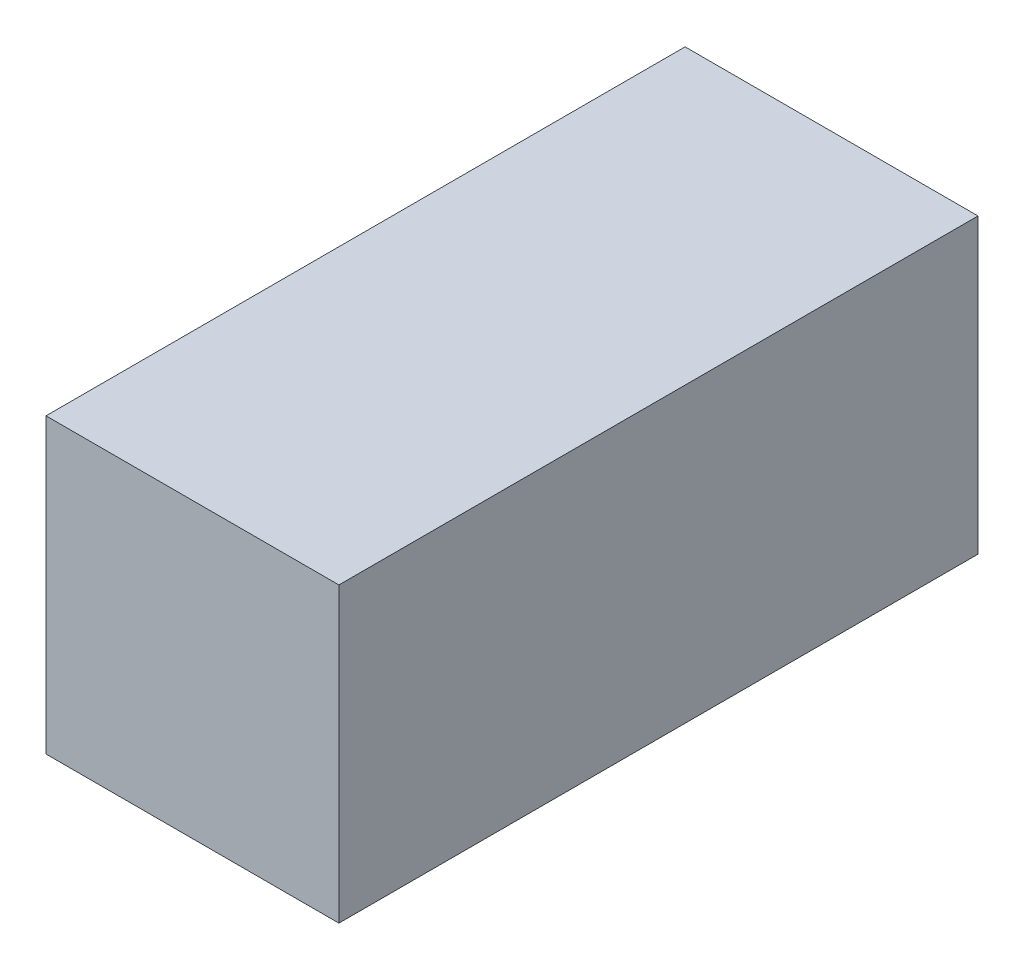
ISO-10303-21;
HEADER;
FILE_DESCRIPTION(('STEP AP214'),'2;1');
FILE_NAME('part.step','',(''),(''),'','','');
FILE_SCHEMA(('AUTOMOTIVE_DESIGN { 1 0 10303 214 1 1 1 1 }'));
ENDSEC;
DATA;
#1=APPLICATION_CONTEXT('core data for automotive mechanical design processes');
#2=APPLICATION_PROTOCOL_DEFINITION('international standard','automotive_design',2000,#1);
#3=PRODUCT_CONTEXT('',#1,'mechanical');
#4=PRODUCT('Part','Part','',(#3));
#5=PRODUCT_RELATED_PRODUCT_CATEGORY('part','',(#4));
#6=PRODUCT_DEFINITION_FORMATION('','',#4);
#7=PRODUCT_DEFINITION_CONTEXT('part definition',#1,'design');
#8=PRODUCT_DEFINITION('design','',#6,#7);
#9=PRODUCT_DEFINITION_SHAPE('','',#8);
#10=(LENGTH_UNIT() NAMED_UNIT(*) SI_UNIT(.MILLI.,.METRE.));
#11=(NAMED_UNIT(*) PLANE_ANGLE_UNIT() SI_UNIT($,.RADIAN.));
#12=(NAMED_UNIT(*) SI_UNIT($,.STERADIAN.) SOLID_ANGLE_UNIT());
#13=UNCERTAINTY_MEASURE_WITH_UNIT(LENGTH_MEASURE(1.E-05),#10,'distance_accuracy_value','');
#14=(GEOMETRIC_REPRESENTATION_CONTEXT(3) GLOBAL_UNCERTAINTY_ASSIGNED_CONTEXT((#13)) GLOBAL_UNIT_ASSIGNED_CONTEXT((#10,
#11,#12)) REPRESENTATION_CONTEXT('',''));
#15=CARTESIAN_POINT('',(0.,0.,0.));
#16=DIRECTION('',(0.,0.,1.));
#17=DIRECTION('',(1.,0.,0.));
#18=AXIS2_PLACEMENT_3D('',#15,#16,#17);
#19=CARTESIAN_POINT('',(139.7,279.4,-304.8));
#20=DIRECTION('',(-1.,0.,0.));
#21=DIRECTION('',(0.,0.,1.));
#22=AXIS2_PLACEMENT_3D('',#19,#20,#21);
#23=PLANE('',#22);
#24=DIRECTION('',(0.,0.,-1.));
#25=VECTOR('',#24,1.);
#26=CARTESIAN_POINT('',(139.7,0.,-304.8));
#27=LINE('',#26,#25);
#28=CARTESIAN_POINT('',(139.7,0.,304.8));
#29=VERTEX_POINT('',#28);
#30=CARTESIAN_POINT('',(139.7,0.,-304.8));
#31=VERTEX_POINT('',#30);
#32=EDGE_CURVE('E132',#29,#31,#27,.T.);
#33=ORIENTED_EDGE('',*,*,#32,.T.);
#34=DIRECTION('',(0.,-1.,0.));
#35=VECTOR('',#34,1.);
#36=CARTESIAN_POINT('',(139.7,279.4,-304.8));
#37=LINE('',#36,#35);
#38=CARTESIAN_POINT('',(139.7,279.4,-304.8));
#39=VERTEX_POINT('',#38);
#40=EDGE_CURVE('E11',#39,#31,#37,.T.);
#41=ORIENTED_EDGE('',*,*,#40,.F.);
#42=DIRECTION('',(0.,0.,-1.));
#43=VECTOR('',#42,1.);
#44=CARTESIAN_POINT('',(139.7,279.4,-304.8));
#45=LINE('',#44,#43);
#46=CARTESIAN_POINT('',(139.7,279.4,304.8));
#47=VERTEX_POINT('',#46);
#48=EDGE_CURVE('E142',#47,#39,#45,.T.);
#49=ORIENTED_EDGE('',*,*,#48,.F.);
#50=DIRECTION('',(0.,-1.,0.));
#51=VECTOR('',#50,1.);
#52=CARTESIAN_POINT('',(139.7,279.4,304.8));
#53=LINE('',#52,#51);
#54=EDGE_CURVE('E147',#47,#29,#53,.T.);
#55=ORIENTED_EDGE('',*,*,#54,.T.);
#56=EDGE_LOOP('',(#33,#41,#49,#55));
#57=FACE_BOUND('',#56,.T.);
#58=ADVANCED_FACE('F34',(#57),#23,.F.);
#59=CARTESIAN_POINT('',(-139.7,279.4,-304.8));
#60=DIRECTION('',(0.,0.,1.));
#61=DIRECTION('',(1.,0.,0.));
#62=AXIS2_PLACEMENT_3D('',#59,#60,#61);
#63=PLANE('',#62);
#64=DIRECTION('',(-1.,0.,0.));
#65=VECTOR('',#64,1.);
#66=CARTESIAN_POINT('',(-139.7,0.,-304.8));
#67=LINE('',#66,#65);
#68=CARTESIAN_POINT('',(-139.7,0.,-304.8));
#69=VERTEX_POINT('',#68);
#70=EDGE_CURVE('E136',#31,#69,#67,.T.);
#71=ORIENTED_EDGE('',*,*,#70,.T.);
#72=DIRECTION('',(0.,-1.,0.));
#73=VECTOR('',#72,1.);
#74=CARTESIAN_POINT('',(-139.7,279.4,-304.8));
#75=LINE('',#74,#73);
#76=CARTESIAN_POINT('',(-139.7,279.4,-304.8));
#77=VERTEX_POINT('',#76);
#78=EDGE_CURVE('E42',#77,#69,#75,.T.);
#79=ORIENTED_EDGE('',*,*,#78,.F.);
#80=DIRECTION('',(-1.,0.,0.));
#81=VECTOR('',#80,1.);
#82=CARTESIAN_POINT('',(-139.7,279.4,-304.8));
#83=LINE('',#82,#81);
#84=EDGE_CURVE('E81',#39,#77,#83,.T.);
#85=ORIENTED_EDGE('',*,*,#84,.F.);
#86=ORIENTED_EDGE('',*,*,#40,.T.);
#87=EDGE_LOOP('',(#71,#79,#85,#86));
#88=FACE_BOUND('',#87,.T.);
#89=ADVANCED_FACE('F171',(#88),#63,.F.);
#90=CARTESIAN_POINT('',(-139.7,279.4,-304.8));
#91=DIRECTION('',(1.,0.,0.));
#92=DIRECTION('',(0.,0.,-1.));
#93=AXIS2_PLACEMENT_3D('',#90,#91,#92);
#94=PLANE('',#93);
#95=DIRECTION('',(0.,0.,1.));
#96=VECTOR('',#95,1.);
#97=CARTESIAN_POINT('',(-139.7,0.,-304.8));
#98=LINE('',#97,#96);
#99=CARTESIAN_POINT('',(-139.7,0.,304.8));
#100=VERTEX_POINT('',#99);
#101=EDGE_CURVE('E68',#69,#100,#98,.T.);
#102=ORIENTED_EDGE('',*,*,#101,.T.);
#103=DIRECTION('',(0.,-1.,0.));
#104=VECTOR('',#103,1.);
#105=CARTESIAN_POINT('',(-139.7,279.4,304.8));
#106=LINE('',#105,#104);
#107=CARTESIAN_POINT('',(-139.7,279.4,304.8));
#108=VERTEX_POINT('',#107);
#109=EDGE_CURVE('E153',#108,#100,#106,.T.);
#110=ORIENTED_EDGE('',*,*,#109,.F.);
#111=DIRECTION('',(0.,0.,1.));
#112=VECTOR('',#111,1.);
#113=CARTESIAN_POINT('',(-139.7,279.4,-304.8));
#114=LINE('',#113,#112);
#115=EDGE_CURVE('E145',#77,#108,#114,.T.);
#116=ORIENTED_EDGE('',*,*,#115,.F.);
#117=ORIENTED_EDGE('',*,*,#78,.T.);
#118=EDGE_LOOP('',(#102,#110,#116,#117));
#119=FACE_BOUND('',#118,.T.);
#120=ADVANCED_FACE('F155',(#119),#94,.F.);
#121=CARTESIAN_POINT('',(-139.7,279.4,304.8));
#122=DIRECTION('',(0.,0.,-1.));
#123=DIRECTION('',(-1.,0.,0.));
#124=AXIS2_PLACEMENT_3D('',#121,#122,#123);
#125=PLANE('',#124);
#126=DIRECTION('',(1.,0.,0.));
#127=VECTOR('',#126,1.);
#128=CARTESIAN_POINT('',(-139.7,0.,304.8));
#129=LINE('',#128,#127);
#130=EDGE_CURVE('E74',#100,#29,#129,.T.);
#131=ORIENTED_EDGE('',*,*,#130,.T.);
#132=ORIENTED_EDGE('',*,*,#54,.F.);
#133=DIRECTION('',(1.,0.,0.));
#134=VECTOR('',#133,1.);
#135=CARTESIAN_POINT('',(-139.7,279.4,304.8));
#136=LINE('',#135,#134);
#137=EDGE_CURVE('E50',#108,#47,#136,.T.);
#138=ORIENTED_EDGE('',*,*,#137,.F.);
#139=ORIENTED_EDGE('',*,*,#109,.T.);
#140=EDGE_LOOP('',(#131,#132,#138,#139));
#141=FACE_BOUND('',#140,.T.);
#142=ADVANCED_FACE('F162',(#141),#125,.F.);
#143=CARTESIAN_POINT('',(0.,279.4,0.));
#144=DIRECTION('',(0.,1.,0.));
#145=DIRECTION('',(0.,0.,1.));
#146=AXIS2_PLACEMENT_3D('',#143,#144,#145);
#147=PLANE('',#146);
#148=ORIENTED_EDGE('',*,*,#48,.T.);
#149=ORIENTED_EDGE('',*,*,#84,.T.);
#150=ORIENTED_EDGE('',*,*,#115,.T.);
#151=ORIENTED_EDGE('',*,*,#137,.T.);
#152=EDGE_LOOP('',(#148,#149,#150,#151));
#153=FACE_BOUND('',#152,.T.);
#154=ADVANCED_FACE('F164',(#153),#147,.T.);
#155=CARTESIAN_POINT('',(0.,0.,0.));
#156=DIRECTION('',(0.,1.,0.));
#157=DIRECTION('',(0.,0.,1.));
#158=AXIS2_PLACEMENT_3D('',#155,#156,#157);
#159=PLANE('',#158);
#160=ORIENTED_EDGE('',*,*,#32,.F.);
#161=ORIENTED_EDGE('',*,*,#130,.F.);
#162=ORIENTED_EDGE('',*,*,#101,.F.);
#163=ORIENTED_EDGE('',*,*,#70,.F.);
#164=EDGE_LOOP('',(#160,#161,#162,#163));
#165=FACE_BOUND('',#164,.T.);
#166=ADVANCED_FACE('F158',(#165),#159,.F.);
#167=CLOSED_SHELL('',(#58,#89,#120,#142,#154,#166));
#168=CARTESIAN_POINT('',(137.16,276.86,-304.8));
#169=DIRECTION('',(-1.,0.,0.));
#170=DIRECTION('',(0.,0.,1.));
#171=AXIS2_PLACEMENT_3D('',#168,#169,#170);
#172=PLANE('',#171);
#173=DIRECTION('',(0.,0.,-1.));
#174=VECTOR('',#173,1.);
#175=CARTESIAN_POINT('',(137.16,2.54,-304.8));
#176=LINE('',#175,#174);
#177=CARTESIAN_POINT('',(137.16,2.54,302.26));
#178=VERTEX_POINT('',#177);
#179=CARTESIAN_POINT('',(137.16,2.54,-302.26));
#180=VERTEX_POINT('',#179);
#181=EDGE_CURVE('E261',#178,#180,#176,.T.);
#182=ORIENTED_EDGE('',*,*,#181,.F.);
#183=DIRECTION('',(0.,-1.,0.));
#184=VECTOR('',#183,1.);
#185=CARTESIAN_POINT('',(137.16,276.86,302.26));
#186=LINE('',#185,#184);
#187=CARTESIAN_POINT('',(137.16,276.86,302.26));
#188=VERTEX_POINT('',#187);
#189=EDGE_CURVE('E127',#188,#178,#186,.T.);
#190=ORIENTED_EDGE('',*,*,#189,.F.);
#191=DIRECTION('',(0.,0.,-1.));
#192=VECTOR('',#191,1.);
#193=CARTESIAN_POINT('',(137.16,276.86,-304.8));
#194=LINE('',#193,#192);
#195=CARTESIAN_POINT('',(137.16,276.86,-302.26));
#196=VERTEX_POINT('',#195);
#197=EDGE_CURVE('E112',#188,#196,#194,.T.);
#198=ORIENTED_EDGE('',*,*,#197,.T.);
#199=DIRECTION('',(0.,-1.,0.));
#200=VECTOR('',#199,1.);
#201=CARTESIAN_POINT('',(137.16,276.86,-302.26));
#202=LINE('',#201,#200);
#203=EDGE_CURVE('E124',#196,#180,#202,.T.);
#204=ORIENTED_EDGE('',*,*,#203,.T.);
#205=EDGE_LOOP('',(#182,#190,#198,#204));
#206=FACE_BOUND('',#205,.T.);
#207=ADVANCED_FACE('F123',(#206),#172,.T.);
#208=CARTESIAN_POINT('',(-139.7,276.86,-302.26));
#209=DIRECTION('',(0.,0.,1.));
#210=DIRECTION('',(1.,0.,0.));
#211=AXIS2_PLACEMENT_3D('',#208,#209,#210);
#212=PLANE('',#211);
#213=DIRECTION('',(-1.,0.,0.));
#214=VECTOR('',#213,1.);
#215=CARTESIAN_POINT('',(-139.7,2.54,-302.26));
#216=LINE('',#215,#214);
#217=CARTESIAN_POINT('',(-137.16,2.54,-302.26));
#218=VERTEX_POINT('',#217);
#219=EDGE_CURVE('E131',#180,#218,#216,.T.);
#220=ORIENTED_EDGE('',*,*,#219,.F.);
#221=ORIENTED_EDGE('',*,*,#203,.F.);
#222=DIRECTION('',(-1.,0.,0.));
#223=VECTOR('',#222,1.);
#224=CARTESIAN_POINT('',(-139.7,276.86,-302.26));
#225=LINE('',#224,#223);
#226=CARTESIAN_POINT('',(-137.16,276.86,-302.26));
#227=VERTEX_POINT('',#226);
#228=EDGE_CURVE('E108',#196,#227,#225,.T.);
#229=ORIENTED_EDGE('',*,*,#228,.T.);
#230=DIRECTION('',(0.,-1.,0.));
#231=VECTOR('',#230,1.);
#232=CARTESIAN_POINT('',(-137.16,276.86,-302.26));
#233=LINE('',#232,#231);
#234=EDGE_CURVE('E133',#227,#218,#233,.T.);
#235=ORIENTED_EDGE('',*,*,#234,.T.);
#236=EDGE_LOOP('',(#220,#221,#229,#235));
#237=FACE_BOUND('',#236,.T.);
#238=ADVANCED_FACE('F130',(#237),#212,.T.);
#239=CARTESIAN_POINT('',(-137.16,276.86,-304.8));
#240=DIRECTION('',(1.,0.,0.));
#241=DIRECTION('',(0.,0.,-1.));
#242=AXIS2_PLACEMENT_3D('',#239,#240,#241);
#243=PLANE('',#242);
#244=DIRECTION('',(0.,0.,1.));
#245=VECTOR('',#244,1.);
#246=CARTESIAN_POINT('',(-137.16,2.54,-304.8));
#247=LINE('',#246,#245);
#248=CARTESIAN_POINT('',(-137.16,2.54,302.26));
#249=VERTEX_POINT('',#248);
#250=EDGE_CURVE('E264',#218,#249,#247,.T.);
#251=ORIENTED_EDGE('',*,*,#250,.F.);
#252=ORIENTED_EDGE('',*,*,#234,.F.);
#253=DIRECTION('',(0.,0.,1.));
#254=VECTOR('',#253,1.);
#255=CARTESIAN_POINT('',(-137.16,276.86,-304.8));
#256=LINE('',#255,#254);
#257=CARTESIAN_POINT('',(-137.16,276.86,302.26));
#258=VERTEX_POINT('',#257);
#259=EDGE_CURVE('E113',#227,#258,#256,.T.);
#260=ORIENTED_EDGE('',*,*,#259,.T.);
#261=DIRECTION('',(0.,-1.,0.));
#262=VECTOR('',#261,1.);
#263=CARTESIAN_POINT('',(-137.16,276.86,302.26));
#264=LINE('',#263,#262);
#265=EDGE_CURVE('E138',#258,#249,#264,.T.);
#266=ORIENTED_EDGE('',*,*,#265,.T.);
#267=EDGE_LOOP('',(#251,#252,#260,#266));
#268=FACE_BOUND('',#267,.T.);
#269=ADVANCED_FACE('F219',(#268),#243,.T.);
#270=CARTESIAN_POINT('',(-139.7,276.86,302.26));
#271=DIRECTION('',(0.,0.,-1.));
#272=DIRECTION('',(-1.,0.,0.));
#273=AXIS2_PLACEMENT_3D('',#270,#271,#272);
#274=PLANE('',#273);
#275=DIRECTION('',(1.,0.,0.));
#276=VECTOR('',#275,1.);
#277=CARTESIAN_POINT('',(-139.7,2.54,302.26));
#278=LINE('',#277,#276);
#279=EDGE_CURVE('E128',#249,#178,#278,.T.);
#280=ORIENTED_EDGE('',*,*,#279,.F.);
#281=ORIENTED_EDGE('',*,*,#265,.F.);
#282=DIRECTION('',(1.,0.,0.));
#283=VECTOR('',#282,1.);
#284=CARTESIAN_POINT('',(-139.7,276.86,302.26));
#285=LINE('',#284,#283);
#286=EDGE_CURVE('E267',#258,#188,#285,.T.);
#287=ORIENTED_EDGE('',*,*,#286,.T.);
#288=ORIENTED_EDGE('',*,*,#189,.T.);
#289=EDGE_LOOP('',(#280,#281,#287,#288));
#290=FACE_BOUND('',#289,.T.);
#291=ADVANCED_FACE('F228',(#290),#274,.T.);
#292=CARTESIAN_POINT('',(0.,276.86,0.));
#293=DIRECTION('',(0.,1.,0.));
#294=DIRECTION('',(0.,0.,1.));
#295=AXIS2_PLACEMENT_3D('',#292,#293,#294);
#296=PLANE('',#295);
#297=ORIENTED_EDGE('',*,*,#197,.F.);
#298=ORIENTED_EDGE('',*,*,#286,.F.);
#299=ORIENTED_EDGE('',*,*,#259,.F.);
#300=ORIENTED_EDGE('',*,*,#228,.F.);
#301=EDGE_LOOP('',(#297,#298,#299,#300));
#302=FACE_BOUND('',#301,.T.);
#303=ADVANCED_FACE('F110',(#302),#296,.F.);
#304=CARTESIAN_POINT('',(0.,2.54,0.));
#305=DIRECTION('',(0.,1.,0.));
#306=DIRECTION('',(0.,0.,1.));
#307=AXIS2_PLACEMENT_3D('',#304,#305,#306);
#308=PLANE('',#307);
#309=ORIENTED_EDGE('',*,*,#181,.T.);
#310=ORIENTED_EDGE('',*,*,#219,.T.);
#311=ORIENTED_EDGE('',*,*,#250,.T.);
#312=ORIENTED_EDGE('',*,*,#279,.T.);
#313=EDGE_LOOP('',(#309,#310,#311,#312));
#314=FACE_BOUND('',#313,.T.);
#315=ADVANCED_FACE('F247',(#314),#308,.T.);
#316=CLOSED_SHELL('',(#207,#238,#269,#291,#303,#315));
#317=ORIENTED_CLOSED_SHELL('',*,#316,.T.);
#318=BREP_WITH_VOIDS('B2',#167,(#317));
#319=ADVANCED_BREP_SHAPE_REPRESENTATION('',(#18,#318),#14);
#320=SHAPE_DEFINITION_REPRESENTATION(#9,#319);
ENDSEC;
END-ISO-10303-21;
